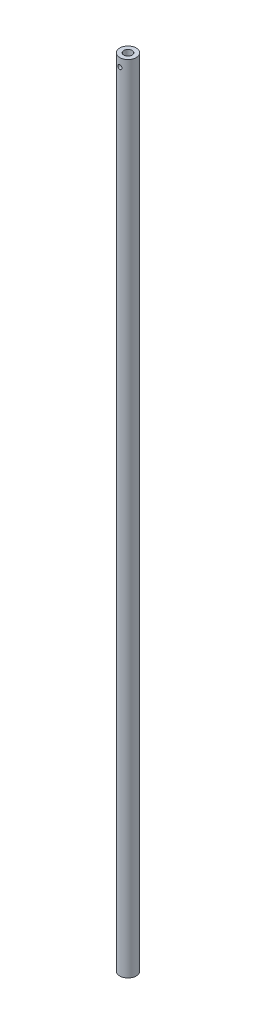
ISO-10303-21;
HEADER;
FILE_DESCRIPTION(('STEP AP214'),'2;1');
FILE_NAME('part.step','',(''),(''),'','','');
FILE_SCHEMA(('AUTOMOTIVE_DESIGN { 1 0 10303 214 1 1 1 1 }'));
ENDSEC;
DATA;
#1=APPLICATION_CONTEXT('core data for automotive mechanical design processes');
#2=APPLICATION_PROTOCOL_DEFINITION('international standard','automotive_design',2000,#1);
#3=PRODUCT_CONTEXT('',#1,'mechanical');
#4=PRODUCT('Part','Part','',(#3));
#5=PRODUCT_RELATED_PRODUCT_CATEGORY('part','',(#4));
#6=PRODUCT_DEFINITION_FORMATION('','',#4);
#7=PRODUCT_DEFINITION_CONTEXT('part definition',#1,'design');
#8=PRODUCT_DEFINITION('design','',#6,#7);
#9=PRODUCT_DEFINITION_SHAPE('','',#8);
#10=(LENGTH_UNIT() NAMED_UNIT(*) SI_UNIT(.MILLI.,.METRE.));
#11=(NAMED_UNIT(*) PLANE_ANGLE_UNIT() SI_UNIT($,.RADIAN.));
#12=(NAMED_UNIT(*) SI_UNIT($,.STERADIAN.) SOLID_ANGLE_UNIT());
#13=UNCERTAINTY_MEASURE_WITH_UNIT(LENGTH_MEASURE(1.E-05),#10,'distance_accuracy_value','');
#14=(GEOMETRIC_REPRESENTATION_CONTEXT(3) GLOBAL_UNCERTAINTY_ASSIGNED_CONTEXT((#13)) GLOBAL_UNIT_ASSIGNED_CONTEXT((#10,
#11,#12)) REPRESENTATION_CONTEXT('',''));
#15=CARTESIAN_POINT('',(0.,0.,0.));
#16=DIRECTION('',(0.,0.,1.));
#17=DIRECTION('',(1.,0.,0.));
#18=AXIS2_PLACEMENT_3D('',#15,#16,#17);
#19=CARTESIAN_POINT('',(0.,1219.2,0.));
#20=DIRECTION('',(0.,1.,0.));
#21=DIRECTION('',(0.,0.,1.));
#22=AXIS2_PLACEMENT_3D('',#19,#20,#21);
#23=PLANE('',#22);
#24=CARTESIAN_POINT('',(0.,1219.2,0.));
#25=DIRECTION('',(0.,1.,0.));
#26=DIRECTION('',(0.,0.,1.));
#27=AXIS2_PLACEMENT_3D('',#24,#25,#26);
#28=CIRCLE('',#27,12.7);
#29=CARTESIAN_POINT('',(0.,1219.2,12.7));
#30=VERTEX_POINT('',#29);
#31=EDGE_CURVE('E10',#30,#30,#28,.T.);
#32=ORIENTED_EDGE('',*,*,#31,.T.);
#33=EDGE_LOOP('',(#32));
#34=FACE_BOUND('',#33,.T.);
#35=CARTESIAN_POINT('',(0.,1219.2,0.));
#36=DIRECTION('',(0.,1.,0.));
#37=DIRECTION('',(0.,0.,1.));
#38=AXIS2_PLACEMENT_3D('',#35,#36,#37);
#39=CIRCLE('',#38,6.34999999999999);
#40=CARTESIAN_POINT('',(0.,1219.2,6.34999999999999));
#41=VERTEX_POINT('',#40);
#42=EDGE_CURVE('E54',#41,#41,#39,.T.);
#43=ORIENTED_EDGE('',*,*,#42,.F.);
#44=EDGE_LOOP('',(#43));
#45=FACE_BOUND('',#44,.T.);
#46=ADVANCED_FACE('F35',(#34,#45),#23,.T.);
#47=CARTESIAN_POINT('',(0.,0.,0.));
#48=DIRECTION('',(0.,1.,0.));
#49=DIRECTION('',(0.,0.,1.));
#50=AXIS2_PLACEMENT_3D('',#47,#48,#49);
#51=PLANE('',#50);
#52=CARTESIAN_POINT('',(0.,0.,0.));
#53=DIRECTION('',(0.,1.,0.));
#54=DIRECTION('',(0.,0.,1.));
#55=AXIS2_PLACEMENT_3D('',#52,#53,#54);
#56=CIRCLE('',#55,12.7);
#57=CARTESIAN_POINT('',(0.,0.,12.7));
#58=VERTEX_POINT('',#57);
#59=EDGE_CURVE('E49',#58,#58,#56,.T.);
#60=ORIENTED_EDGE('',*,*,#59,.F.);
#61=EDGE_LOOP('',(#60));
#62=FACE_BOUND('',#61,.T.);
#63=CARTESIAN_POINT('',(0.,0.,0.));
#64=DIRECTION('',(0.,1.,0.));
#65=DIRECTION('',(0.,0.,1.));
#66=AXIS2_PLACEMENT_3D('',#63,#64,#65);
#67=CIRCLE('',#66,6.34999999999999);
#68=CARTESIAN_POINT('',(0.,0.,6.34999999999999));
#69=VERTEX_POINT('',#68);
#70=EDGE_CURVE('E57',#69,#69,#67,.T.);
#71=ORIENTED_EDGE('',*,*,#70,.T.);
#72=EDGE_LOOP('',(#71));
#73=FACE_BOUND('',#72,.T.);
#74=ADVANCED_FACE('F93',(#62,#73),#51,.F.);
#75=CARTESIAN_POINT('',(0.,1219.2,0.));
#76=DIRECTION('',(0.,-1.,0.));
#77=DIRECTION('',(0.,0.,-1.));
#78=AXIS2_PLACEMENT_3D('',#75,#76,#77);
#79=CYLINDRICAL_SURFACE('',#78,12.7);
#80=CARTESIAN_POINT('',(3.17499999999981,1206.5,12.2967221242086));
#81=CARTESIAN_POINT('',(3.17499501981301,1206.32467554633,12.2967254711159));
#82=CARTESIAN_POINT('',(3.16042833178181,1206.14929597868,12.3005126863854));
#83=CARTESIAN_POINT('',(3.1026393693388,1205.80357317572,12.3152136473056));
#84=CARTESIAN_POINT('',(3.05940041756226,1205.63323293183,12.3261315404947));
#85=CARTESIAN_POINT('',(2.94575382353251,1205.3026395065,12.3537818023711));
#86=CARTESIAN_POINT('',(2.87538125437504,1205.14237361266,12.3705066621688));
#87=CARTESIAN_POINT('',(2.70957184940179,1204.83590521728,12.4078770387653));
#88=CARTESIAN_POINT('',(2.61413394947187,1204.68970331316,12.4285227220068));
#89=CARTESIAN_POINT('',(2.39865970268589,1204.41229571052,12.4719170977165));
#90=CARTESIAN_POINT('',(2.27817284738401,1204.28144512756,12.4946993898125));
#91=CARTESIAN_POINT('',(2.01699122140778,1204.04158302916,12.5395085190442));
#92=CARTESIAN_POINT('',(1.87629456360893,1203.93257355546,12.5615352853931));
#93=CARTESIAN_POINT('',(1.57625440537023,1203.73803515611,12.6027232771114));
#94=CARTESIAN_POINT('',(1.41667811176777,1203.65285508704,12.6218402299875));
#95=CARTESIAN_POINT('',(1.08491424405178,1203.51066175193,12.65467131146));
#96=CARTESIAN_POINT('',(0.912728534955732,1203.45364433007,12.6683862371462));
#97=CARTESIAN_POINT('',(0.564335623617743,1203.37053225009,12.6886304373719));
#98=CARTESIAN_POINT('',(0.388280553827151,1203.34383455171,12.6952996518228));
#99=CARTESIAN_POINT('',(0.0340726004636605,1203.32022685832,12.7011886451627));
#100=CARTESIAN_POINT('',(-0.144079969063406,1203.3233124593,12.7004095254281));
#101=CARTESIAN_POINT('',(-0.493243384772358,1203.35875005982,12.6915938059099));
#102=CARTESIAN_POINT('',(-0.664324984533385,1203.39045113282,12.683718629729));
#103=CARTESIAN_POINT('',(-0.998658935538431,1203.48117351296,12.6617836238657));
#104=CARTESIAN_POINT('',(-1.16191086950113,1203.54019627443,12.6477234649603));
#105=CARTESIAN_POINT('',(-1.47766628361825,1203.68441326477,12.6147513732012));
#106=CARTESIAN_POINT('',(-1.63005931850868,1203.76983914672,12.5957967501266));
#107=CARTESIAN_POINT('',(-1.91857510093102,1203.96426171248,12.5550917783831));
#108=CARTESIAN_POINT('',(-2.05469501139639,1204.07326249707,12.5333409435887));
#109=CARTESIAN_POINT('',(-2.31068256139461,1204.31523010232,12.4887191648708));
#110=CARTESIAN_POINT('',(-2.43001063106365,1204.44876571328,12.4658338379713));
#111=CARTESIAN_POINT('',(-2.64469999368251,1204.7341919664,12.4220610526701));
#112=CARTESIAN_POINT('',(-2.74006016644604,1204.88608346596,12.4011736876753));
#113=CARTESIAN_POINT('',(-2.90445230964658,1205.20496834337,12.3637103097324));
#114=CARTESIAN_POINT('',(-2.97335437513104,1205.3720313775,12.347155693206));
#115=CARTESIAN_POINT('',(-3.08192684552036,1205.71588354446,12.3205067298881));
#116=CARTESIAN_POINT('',(-3.12160350580581,1205.89267058726,12.3104110007027));
#117=CARTESIAN_POINT('',(-3.16970364110553,1206.24594856695,12.2981130212947));
#118=CARTESIAN_POINT('',(-3.17892490187709,1206.42232399755,12.2957093300071));
#119=CARTESIAN_POINT('',(-3.16803657795405,1206.77409385947,12.2985192607316));
#120=CARTESIAN_POINT('',(-3.14792969326905,1206.9494883796,12.3037321815429));
#121=CARTESIAN_POINT('',(-3.07965533920138,1207.29135511649,12.3209949412093));
#122=CARTESIAN_POINT('',(-3.03195236671779,1207.45792636274,12.3329315220802));
#123=CARTESIAN_POINT('',(-2.91035496372127,1207.78070795148,12.3621891219377));
#124=CARTESIAN_POINT('',(-2.83645743059471,1207.936917064,12.3795107787294));
#125=CARTESIAN_POINT('',(-2.66289874827928,1208.23792042289,12.418010941113));
#126=CARTESIAN_POINT('',(-2.56276062737097,1208.38243062686,12.4392584413121));
#127=CARTESIAN_POINT('',(-2.34016643006656,1208.65288922076,12.4830469550032));
#128=CARTESIAN_POINT('',(-2.21770668600701,1208.77883455415,12.5055881806495));
#129=CARTESIAN_POINT('',(-1.95028413912631,1209.01182002407,12.5501070185035));
#130=CARTESIAN_POINT('',(-1.80483494928761,1209.11830827944,12.5720564161859));
#131=CARTESIAN_POINT('',(-1.49765601755539,1209.30534855103,12.6123346509939));
#132=CARTESIAN_POINT('',(-1.33592712544014,1209.38590192009,12.6306636769502));
#133=CARTESIAN_POINT('',(-1.00189729049598,1209.51808646385,12.6615204698767));
#134=CARTESIAN_POINT('',(-0.829682684763281,1209.56992564116,12.6740898412846));
#135=CARTESIAN_POINT('',(-0.478630489012009,1209.64383462495,12.6921932261265));
#136=CARTESIAN_POINT('',(-0.299794184005794,1209.6659101766,12.6977285972964));
#137=CARTESIAN_POINT('',(0.054240196457629,1209.6793420969,12.7010848787296));
#138=CARTESIAN_POINT('',(0.229405900617189,1209.67151292638,12.6991103294396));
#139=CARTESIAN_POINT('',(0.575841801116885,1209.62722314834,12.6881222125238));
#140=CARTESIAN_POINT('',(0.747112113154488,1209.59076339233,12.6791088542401));
#141=CARTESIAN_POINT('',(1.08004303817218,1209.49068420223,12.655087493111));
#142=CARTESIAN_POINT('',(1.24175042029425,1209.42721203573,12.6401120229509));
#143=CARTESIAN_POINT('',(1.55231164340715,1209.27504341161,12.6057434230086));
#144=CARTESIAN_POINT('',(1.70116386101837,1209.18634377427,12.5863497364055));
#145=CARTESIAN_POINT('',(1.98565112274395,1208.98375413206,12.5446551773491));
#146=CARTESIAN_POINT('',(2.12088408784716,1208.86931154628,12.5222957878978));
#147=CARTESIAN_POINT('',(2.37050268936831,1208.61955744497,12.4774531075658));
#148=CARTESIAN_POINT('',(2.48488303211812,1208.48424064635,12.4549697867118));
#149=CARTESIAN_POINT('',(2.69164443404795,1208.19354050995,12.4119473580947));
#150=CARTESIAN_POINT('',(2.78357526664683,1208.03782990832,12.3914523466269));
#151=CARTESIAN_POINT('',(2.93981789665869,1207.71267381965,12.3553205869608));
#152=CARTESIAN_POINT('',(3.00414978846293,1207.54323843265,12.3396803064046));
#153=CARTESIAN_POINT('',(3.09379152821277,1207.22841798743,12.3174731028359));
#154=CARTESIAN_POINT('',(3.1241783166449,1207.08453920308,12.3097500503611));
#155=CARTESIAN_POINT('',(3.16478377891517,1206.79378634093,12.2993733749982));
#156=CARTESIAN_POINT('',(3.17500417313011,1206.64691251973,12.2967193196792));
#157=CARTESIAN_POINT('',(3.17499999999981,1206.5,12.2967221242086));
#158=B_SPLINE_CURVE_WITH_KNOTS('',3,(#80,#81,#82,#83,#84,#85,#86,#87,#88,#89,#90,#91,#92,#93,
#94,#95,#96,#97,#98,#99,#100,#101,#102,#103,#104,#105,#106,#107,#108,#109,#110,#111,#112,#113,
#114,#115,#116,#117,#118,#119,#120,#121,#122,#123,#124,#125,#126,#127,#128,#129,#130,#131,#132,
#133,#134,#135,#136,#137,#138,#139,#140,#141,#142,#143,#144,#145,#146,#147,#148,#149,#150,#151,
#152,#153,#154,#155,#156,#157),.UNSPECIFIED.,.T.,.F.,(4,2,2,2,2,2,2,2,2,2,2,2,2,2,2,2,2,2,2,2,2,
2,2,2,2,2,2,2,2,2,2,2,2,2,2,2,2,2,4),(0.,0.525433851004964,1.05117359161438,1.57623602350071,
2.10132074979462,2.63682421825055,3.17237772279397,3.71540400425325,4.25835013005777,
4.79029713764062,5.32216548805818,5.84223193614927,6.36232607040448,6.88711950303115,
7.41200429545474,7.95109492546283,8.49021074623711,9.0319406865062,9.57355464164484,
10.1008633995049,10.6281236152965,11.1467570436792,11.6654519221142,12.1943221424736,
12.7232793399023,13.2654717033217,13.8076357797005,14.3458193247102,14.8838989712068,
15.4074297658807,15.9309449907496,16.4516419323703,16.9724045329355,17.5056431266542,
18.0390169009438,18.5823412615961,19.1252693614616,19.5655924052576,20.0058778838693),.UNSPECIFIED.);
#159=CARTESIAN_POINT('',(3.17499999999981,1206.5,12.2967221242086));
#160=VERTEX_POINT('',#159);
#161=EDGE_CURVE('E77',#160,#160,#158,.T.);
#162=ORIENTED_EDGE('',*,*,#161,.T.);
#163=EDGE_LOOP('',(#162));
#164=FACE_BOUND('',#163,.T.);
#165=CARTESIAN_POINT('',(0.,1209.675,-12.7));
#166=CARTESIAN_POINT('',(-0.17542105435093,1209.67499507719,-12.6999970338729));
#167=CARTESIAN_POINT('',(-0.350897100741789,1209.6604128842,-12.6963292371236));
#168=CARTESIAN_POINT('',(-0.696820051980949,1209.60255676307,-12.6820530760661));
#169=CARTESIAN_POINT('',(-0.867264049209693,1209.55926657315,-12.6714407780561));
#170=CARTESIAN_POINT('',(-1.19807751278639,1209.44547024684,-12.6444507573613));
#171=CARTESIAN_POINT('',(-1.35845880926011,1209.37499679272,-12.6280799601569));
#172=CARTESIAN_POINT('',(-1.66512267919763,1209.20894939107,-12.591316443928));
#173=CARTESIAN_POINT('',(-1.81140477687146,1209.11337459688,-12.5709235892463));
#174=CARTESIAN_POINT('',(-2.08873074612015,1208.89775832857,-12.5278602543575));
#175=CARTESIAN_POINT('',(-2.21944287729577,1208.77729716634,-12.5051546346353));
#176=CARTESIAN_POINT('',(-2.45903522924685,1208.51622616628,-12.4602582924963));
#177=CARTESIAN_POINT('',(-2.56791298487556,1208.37561405643,-12.4380676284689));
#178=CARTESIAN_POINT('',(-2.76230618225761,1208.07565677008,-12.3963594189446));
#179=CARTESIAN_POINT('',(-2.84745052370805,1207.91606432812,-12.3768864828385));
#180=CARTESIAN_POINT('',(-2.98957345643229,1207.58426586199,-12.343330973648));
#181=CARTESIAN_POINT('',(-3.04655655068149,1207.41206185945,-12.3292475388652));
#182=CARTESIAN_POINT('',(-3.12960773790324,1207.06357626214,-12.3084267567389));
#183=CARTESIAN_POINT('',(-3.15627230130267,1206.88744547005,-12.3015478927701));
#184=CARTESIAN_POINT('',(-3.17978742389037,1206.53308652895,-12.2954915053947));
#185=CARTESIAN_POINT('',(-3.1766428335148,1206.35485872587,-12.2963127290579));
#186=CARTESIAN_POINT('',(-3.14110481048721,1206.00593654027,-12.3054365167727));
#187=CARTESIAN_POINT('',(-3.10942215340335,1205.8351642679,-12.3135572669877));
#188=CARTESIAN_POINT('',(-3.01884119561117,1205.50143910891,-12.3360753547043));
#189=CARTESIAN_POINT('',(-2.95994095604671,1205.33848678026,-12.3504731393489));
#190=CARTESIAN_POINT('',(-2.81599106163348,1205.02312119893,-12.3840899110032));
#191=CARTESIAN_POINT('',(-2.73068344564274,1204.87083093638,-12.4033560981112));
#192=CARTESIAN_POINT('',(-2.53652078423138,1204.58247206435,-12.4445122129068));
#193=CARTESIAN_POINT('',(-2.42766161831183,1204.44640629993,-12.4664025994163));
#194=CARTESIAN_POINT('',(-2.18580424890842,1204.19028568012,-12.5111061380944));
#195=CARTESIAN_POINT('',(-2.05220624645091,1204.07079799604,-12.533927803951));
#196=CARTESIAN_POINT('',(-1.76659522538266,1203.85581503679,-12.5773596047504));
#197=CARTESIAN_POINT('',(-1.61458164448162,1203.76032049448,-12.5979696721291));
#198=CARTESIAN_POINT('',(-1.29564529770878,1203.59582625916,-12.6347586626604));
#199=CARTESIAN_POINT('',(-1.1286731156248,1203.52691869646,-12.6509221227036));
#200=CARTESIAN_POINT('',(-0.785020883902368,1203.41830836958,-12.676884242985));
#201=CARTESIAN_POINT('',(-0.608342698201796,1203.37860001892,-12.6866841206814));
#202=CARTESIAN_POINT('',(-0.255142937325509,1203.33038148624,-12.6986347345774));
#203=CARTESIAN_POINT('',(-0.0787330573083404,1203.32109892814,-12.7009747992585));
#204=CARTESIAN_POINT('',(0.273119584996554,1203.33187705435,-12.6982813685726));
#205=CARTESIAN_POINT('',(0.448562432914423,1203.35193509726,-12.6932485369525));
#206=CARTESIAN_POINT('',(0.79081686891024,1203.42018842276,-12.6764961338622));
#207=CARTESIAN_POINT('',(0.957717835150496,1203.46796234103,-12.6648767569325));
#208=CARTESIAN_POINT('',(1.2811279356911,1203.58980999453,-12.6362609570897));
#209=CARTESIAN_POINT('',(1.43763601861905,1203.6638863858,-12.6192639911647));
#210=CARTESIAN_POINT('',(1.73889063454306,1203.83773313945,-12.5813250177716));
#211=CARTESIAN_POINT('',(1.88337918521895,1203.93793610457,-12.5603183592593));
#212=CARTESIAN_POINT('',(2.15376466554488,1204.16063864029,-12.5167921111412));
#213=CARTESIAN_POINT('',(2.27965837982656,1204.28314205886,-12.4942722608556));
#214=CARTESIAN_POINT('',(2.51246336908657,1204.55055415045,-12.4495762556412));
#215=CARTESIAN_POINT('',(2.61883285313114,1204.69593897135,-12.4274221051899));
#216=CARTESIAN_POINT('',(2.80566443991207,1205.00295074296,-12.3865825924258));
#217=CARTESIAN_POINT('',(2.88612769264163,1205.16457697229,-12.3678970761539));
#218=CARTESIAN_POINT('',(3.01826384028526,1205.49861711243,-12.3363163381503));
#219=CARTESIAN_POINT('',(3.0701073062283,1205.6709601466,-12.3233869021911));
#220=CARTESIAN_POINT('',(3.14398164687956,1206.02228873346,-12.3047494152553));
#221=CARTESIAN_POINT('',(3.16601904149235,1206.20127282466,-12.2990397850061));
#222=CARTESIAN_POINT('',(3.17931501621055,1206.55528950052,-12.2956087422145));
#223=CARTESIAN_POINT('',(3.17143955029519,1206.73028790439,-12.2976625750886));
#224=CARTESIAN_POINT('',(3.1271152390871,1207.07637656438,-12.3090074061494));
#225=CARTESIAN_POINT('',(3.09066696801918,1207.24746689897,-12.3182982588945));
#226=CARTESIAN_POINT('',(2.99070462615674,1207.57994123835,-12.3429450180984));
#227=CARTESIAN_POINT('',(2.92735297324078,1207.74137696276,-12.3582644892528));
#228=CARTESIAN_POINT('',(2.77551073379646,1208.05144339342,-12.3932474960913));
#229=CARTESIAN_POINT('',(2.68701666057199,1208.20007231991,-12.4129116342002));
#230=CARTESIAN_POINT('',(2.48468673461534,1208.48449063139,-12.4550092586011));
#231=CARTESIAN_POINT('',(2.3702500281642,1208.61984393875,-12.4775016056118));
#232=CARTESIAN_POINT('',(2.12045416901807,1208.86970791149,-12.5223699100401));
#233=CARTESIAN_POINT('',(1.98509005500255,1208.98421362041,-12.5447458385544));
#234=CARTESIAN_POINT('',(1.69432305852032,1209.19115393646,-12.5873437112106));
#235=CARTESIAN_POINT('',(1.53860166056956,1209.28315126561,-12.6075193062447));
#236=CARTESIAN_POINT('',(1.2134131592971,1209.43951546323,-12.6429542453062));
#237=CARTESIAN_POINT('',(1.04395600927437,1209.50390213004,-12.6582171100619));
#238=CARTESIAN_POINT('',(0.729001702698632,1209.5936603742,-12.6798505941374));
#239=CARTESIAN_POINT('',(0.585004695088707,1209.6240967978,-12.6873547169486));
#240=CARTESIAN_POINT('',(0.294017851418451,1209.664767914,-12.6974304774095));
#241=CARTESIAN_POINT('',(0.147028241296866,1209.67500412603,-12.7000024860439));
#242=CARTESIAN_POINT('',(0.,1209.675,-12.7));
#243=B_SPLINE_CURVE_WITH_KNOTS('',3,(#165,#166,#167,#168,#169,#170,#171,#172,#173,#174,#175,
#176,#177,#178,#179,#180,#181,#182,#183,#184,#185,#186,#187,#188,#189,#190,#191,#192,#193,#194,
#195,#196,#197,#198,#199,#200,#201,#202,#203,#204,#205,#206,#207,#208,#209,#210,#211,#212,#213,
#214,#215,#216,#217,#218,#219,#220,#221,#222,#223,#224,#225,#226,#227,#228,#229,#230,#231,#232,
#233,#234,#235,#236,#237,#238,#239,#240,#241,#242),.UNSPECIFIED.,.T.,.F.,(4,2,2,2,2,2,2,2,2,2,2,
2,2,2,2,2,2,2,2,2,2,2,2,2,2,2,2,2,2,2,2,2,2,2,2,2,2,2,4),(0.,0.525724358065482,1.05174676993356,
1.57713870983889,2.10254837335831,2.63767221675251,3.17285644277771,3.71599137305263,
4.25903942808484,4.7912082463057,5.32329047345506,5.84247618671843,6.36169889010119,
6.88616284006707,7.41071862276876,7.95023177058084,8.48976139571939,9.0311441807627,
9.57242335981268,10.0998508728294,10.6272309069561,11.1467958106168,11.6664131950581,
12.1952509368695,12.7241800170726,13.2660921115642,13.8079801469342,14.3466027227594,
14.8851074589663,15.4081433519168,15.9311687337367,16.4510804786756,16.971064359065,
17.5046127008436,18.0382877269745,18.5816279265752,19.1245778677191,19.5652441424426,
20.0058772697448),.UNSPECIFIED.);
#244=CARTESIAN_POINT('',(0.,1209.675,-12.7));
#245=VERTEX_POINT('',#244);
#246=EDGE_CURVE('E82',#245,#245,#243,.T.);
#247=ORIENTED_EDGE('',*,*,#246,.T.);
#248=EDGE_LOOP('',(#247));
#249=FACE_BOUND('',#248,.T.);
#250=ORIENTED_EDGE('',*,*,#31,.F.);
#251=EDGE_LOOP('',(#250));
#252=FACE_BOUND('',#251,.T.);
#253=ORIENTED_EDGE('',*,*,#59,.T.);
#254=EDGE_LOOP('',(#253));
#255=FACE_BOUND('',#254,.T.);
#256=ADVANCED_FACE('F37',(#164,#249,#252,#255),#79,.T.);
#257=CARTESIAN_POINT('',(0.,1219.2,0.));
#258=DIRECTION('',(0.,-1.,0.));
#259=DIRECTION('',(0.,0.,-1.));
#260=AXIS2_PLACEMENT_3D('',#257,#258,#259);
#261=CYLINDRICAL_SURFACE('',#260,6.34999999999999);
#262=CARTESIAN_POINT('',(0.,1209.675,-6.34999999999999));
#263=CARTESIAN_POINT('',(-0.0834969220595042,1209.67499911228,-6.34999931166444));
#264=CARTESIAN_POINT('',(-0.167002655580051,1209.67170012556,-6.34834758911701));
#265=CARTESIAN_POINT('',(-0.333378330258795,1209.65855412545,-6.34179105821714));
#266=CARTESIAN_POINT('',(-0.416247978955787,1209.64870426348,-6.33688483467112));
#267=CARTESIAN_POINT('',(-0.663182030647014,1209.60942793496,-6.31742426748324));
#268=CARTESIAN_POINT('',(-0.825450146761522,1209.5702749226,-6.29812827299425));
#269=CARTESIAN_POINT('',(-1.13965128900417,1209.46800928871,-6.24891823135741));
#270=CARTESIAN_POINT('',(-1.29162180811858,1209.40498978076,-6.21904547786826));
#271=CARTESIAN_POINT('',(-1.58264035037867,1209.25726392637,-6.1514281204164));
#272=CARTESIAN_POINT('',(-1.72168939123007,1209.17255928985,-6.1136841371588));
#273=CARTESIAN_POINT('',(-1.99234108848159,1208.97803037027,-6.03111096182986));
#274=CARTESIAN_POINT('',(-2.12298433900077,1208.86699642221,-5.98599127270823));
#275=CARTESIAN_POINT('',(-2.36467069069839,1208.62560331643,-5.89470535591061));
#276=CARTESIAN_POINT('',(-2.47569885601308,1208.49522957024,-5.84853836069048));
#277=CARTESIAN_POINT('',(-2.68368848497872,1208.20657905225,-5.7562363493447));
#278=CARTESIAN_POINT('',(-2.77889135161918,1208.0469224687,-5.71038146176795));
#279=CARTESIAN_POINT('',(-2.90019349951518,1207.79545201283,-5.64919759286371));
#280=CARTESIAN_POINT('',(-2.93705266116876,1207.70959993817,-5.6300642080594));
#281=CARTESIAN_POINT('',(-3.00322508739591,1207.5344143863,-5.59504604853275));
#282=CARTESIAN_POINT('',(-3.03254280972144,1207.44508300182,-5.57915935583436));
#283=CARTESIAN_POINT('',(-3.08174263292964,1207.26898944804,-5.55212611635058));
#284=CARTESIAN_POINT('',(-3.10208128111959,1207.18238920597,-5.54075429137756));
#285=CARTESIAN_POINT('',(-3.13545600360743,1207.00741272101,-5.52193654886456));
#286=CARTESIAN_POINT('',(-3.14849595237236,1206.91903744623,-5.51448854851147));
#287=CARTESIAN_POINT('',(-3.16707713053421,1206.74129326115,-5.50383875782929));
#288=CARTESIAN_POINT('',(-3.17262287599631,1206.65192498201,-5.50063441026532));
#289=CARTESIAN_POINT('',(-3.17614778806973,1206.47301921582,-5.4985978839862));
#290=CARTESIAN_POINT('',(-3.17412767659852,1206.38348174573,-5.49976528812809));
#291=CARTESIAN_POINT('',(-3.15811930330241,1206.13725212428,-5.50899190362743));
#292=CARTESIAN_POINT('',(-3.13621253452945,1205.98115827019,-5.52160857357718));
#293=CARTESIAN_POINT('',(-3.07003746372149,1205.6753533587,-5.55866493052834));
#294=CARTESIAN_POINT('',(-3.02576203854488,1205.52564435098,-5.58310838358085));
#295=CARTESIAN_POINT('',(-2.9153150983363,1205.23245570344,-5.64157885407245));
#296=CARTESIAN_POINT('',(-2.84865758129396,1205.08920239007,-5.67581583876139));
#297=CARTESIAN_POINT('',(-2.69570761526033,1204.81523391383,-5.75003268807642));
#298=CARTESIAN_POINT('',(-2.60940634674613,1204.68452442039,-5.79001512927811));
#299=CARTESIAN_POINT('',(-2.40685964249551,1204.42189572575,-5.87734289018616));
#300=CARTESIAN_POINT('',(-2.28820488335235,1204.29192461515,-5.92497898403942));
#301=CARTESIAN_POINT('',(-2.0305889844841,1204.05291485714,-6.0181370057491));
#302=CARTESIAN_POINT('',(-1.89161819563533,1203.94388621364,-6.06365791538162));
#303=CARTESIAN_POINT('',(-1.58913989972474,1203.74509808028,-6.15003810597681));
#304=CARTESIAN_POINT('',(-1.4247926516478,1203.65646851442,-6.19058274974573));
#305=CARTESIAN_POINT('',(-1.08098023585572,1203.50884191837,-6.25976272299954));
#306=CARTESIAN_POINT('',(-0.901527205073765,1203.44982135887,-6.28840750578947));
#307=CARTESIAN_POINT('',(-0.548533610626697,1203.3679405966,-6.32854759690358));
#308=CARTESIAN_POINT('',(-0.375734359385128,1203.34249032741,-6.34126679122996));
#309=CARTESIAN_POINT('',(-0.0278752299447635,1203.32034947774,-6.35231817716325));
#310=CARTESIAN_POINT('',(0.147183538060058,1203.32364527286,-6.35065718436129));
#311=CARTESIAN_POINT('',(0.480164686080377,1203.35740623595,-6.33384535408398));
#312=CARTESIAN_POINT('',(0.638363620564208,1203.38574579148,-6.3197500506043));
#313=CARTESIAN_POINT('',(0.94744188305301,1203.46545587821,-6.28085393924121));
#314=CARTESIAN_POINT('',(1.09832040207141,1203.51682894848,-6.25605195113515));
#315=CARTESIAN_POINT('',(1.39347133182508,1203.64249513094,-6.19709998236334));
#316=CARTESIAN_POINT('',(1.53743151047816,1203.71740158411,-6.16270299610718));
#317=CARTESIAN_POINT('',(1.81121482341034,1203.88731642569,-6.08787118465666));
#318=CARTESIAN_POINT('',(1.94103189959924,1203.98233337739,-6.04743378954681));
#319=CARTESIAN_POINT('',(2.19636241342672,1204.20053935038,-5.95973602709941));
#320=CARTESIAN_POINT('',(2.32020134681968,1204.32557860711,-5.91219559251102));
#321=CARTESIAN_POINT('',(2.5458938191886,1204.59476235515,-5.81858093231374));
#322=CARTESIAN_POINT('',(2.6477321493524,1204.73891995238,-5.77250773963551));
#323=CARTESIAN_POINT('',(2.83117262876708,1205.05106860196,-5.68487535288745));
#324=CARTESIAN_POINT('',(2.91155594998005,1205.21987576951,-5.64364281441825));
#325=CARTESIAN_POINT('',(3.04191297152926,1205.57134446489,-5.57447679537326));
#326=CARTESIAN_POINT('',(3.09192585492206,1205.75398779785,-5.54652618900876));
#327=CARTESIAN_POINT('',(3.15551086037902,1206.10918995647,-5.51057765714611));
#328=CARTESIAN_POINT('',(3.17212027309694,1206.28103375041,-5.50092192343254));
#329=CARTESIAN_POINT('',(3.17718805563855,1206.6252444425,-5.4980000114537));
#330=CARTESIAN_POINT('',(3.16565862768363,1206.79761108154,-5.50472672904453));
#331=CARTESIAN_POINT('',(3.11761548073637,1207.12066010308,-5.53205211477795));
#332=CARTESIAN_POINT('',(3.08358651207667,1207.27184394173,-5.55126823076279));
#333=CARTESIAN_POINT('',(2.99458164828787,1207.56619083017,-5.59977978302592));
#334=CARTESIAN_POINT('',(2.93959901505977,1207.70935128285,-5.62907846127346));
#335=CARTESIAN_POINT('',(2.80611544421348,1207.99423369943,-5.69685576337185));
#336=CARTESIAN_POINT('',(2.72628260503911,1208.13521280937,-5.73581889480541));
#337=CARTESIAN_POINT('',(2.54682759156568,1208.40269743172,-5.81772207082388));
#338=CARTESIAN_POINT('',(2.44719512169915,1208.52919535994,-5.86066417820136));
#339=CARTESIAN_POINT('',(2.21680287661202,1208.78009752418,-5.95192753761209));
#340=CARTESIAN_POINT('',(2.08373188558696,1208.90237975641,-6.00026839877351));
#341=CARTESIAN_POINT('',(1.79751265125231,1209.12339787324,-6.09212345576753));
#342=CARTESIAN_POINT('',(1.64435365457418,1209.22212106598,-6.13563504323045));
#343=CARTESIAN_POINT('',(1.40178715704475,1209.3502802662,-6.19391073190245));
#344=CARTESIAN_POINT('',(1.31842200030904,1209.38980058368,-6.21223173271386));
#345=CARTESIAN_POINT('',(1.14807701021657,1209.46159947483,-6.24595363475605));
#346=CARTESIAN_POINT('',(1.06109897786295,1209.49388160654,-6.26135597012705));
#347=CARTESIAN_POINT('',(0.884361322813026,1209.55075934592,-6.28875097111982));
#348=CARTESIAN_POINT('',(0.79460824497049,1209.57537171814,-6.30075106809478));
#349=CARTESIAN_POINT('',(0.612925661591499,1209.61666738953,-6.32100983571903));
#350=CARTESIAN_POINT('',(0.520997521680205,1209.6333555322,-6.3292707916836));
#351=CARTESIAN_POINT('',(0.357531347524305,1209.65561628486,-6.34032503263334));
#352=CARTESIAN_POINT('',(0.286274046488541,1209.66287882125,-6.34394670812889));
#353=CARTESIAN_POINT('',(0.14334666894132,1209.67257112654,-6.34878452045566));
#354=CARTESIAN_POINT('',(0.0716765810914125,1209.67500076205,-6.35000059089051));
#355=CARTESIAN_POINT('',(0.,1209.675,-6.34999999999999));
#356=B_SPLINE_CURVE_WITH_KNOTS('',3,(#262,#263,#264,#265,#266,#267,#268,#269,#270,#271,#272,
#273,#274,#275,#276,#277,#278,#279,#280,#281,#282,#283,#284,#285,#286,#287,#288,#289,#290,#291,
#292,#293,#294,#295,#296,#297,#298,#299,#300,#301,#302,#303,#304,#305,#306,#307,#308,#309,#310,
#311,#312,#313,#314,#315,#316,#317,#318,#319,#320,#321,#322,#323,#324,#325,#326,#327,#328,#329,
#330,#331,#332,#333,#334,#335,#336,#337,#338,#339,#340,#341,#342,#343,#344,#345,#346,#347,#348,
#349,#350,#351,#352,#353,#354,#355),.UNSPECIFIED.,.T.,.F.,(4,2,2,2,2,2,2,2,2,2,2,2,2,2,2,2,2,2,
2,2,2,2,2,2,2,2,2,2,2,2,2,2,2,2,2,2,2,2,2,2,2,2,2,2,2,2,4),(0.,0.250415612102695,
0.500940186864007,1.00234854488127,1.50182051324252,2.0012531094009,2.53090025348436,
3.06094897410598,3.63210298373068,3.91787290005964,4.20347350732838,4.47213270490072,
4.74064915090099,5.00900371453872,5.27733267302546,5.74927594687702,6.221369602568,
6.7044597032772,7.18776712793981,7.73235646527835,8.27720530143594,8.84735553323611,
9.41705196489256,9.93956405039286,10.4618285011669,10.9436138594969,11.4254523397097,
11.9210677568133,12.4168946391873,12.9614122158791,13.5063050164593,14.0775857365543,
14.6481278321874,15.1639000911411,15.6794487286227,16.1458838633204,16.6124691169493,
17.1104020806931,17.6085946442294,18.167321035447,18.7263477502415,19.0082017078353,
19.2899168101031,19.5710117490921,19.8519346536832,20.0668939492135,20.281859177688),.UNSPECIFIED.);
#357=CARTESIAN_POINT('',(0.,1209.675,-6.34999999999999));
#358=VERTEX_POINT('',#357);
#359=EDGE_CURVE('E40',#358,#358,#356,.T.);
#360=ORIENTED_EDGE('',*,*,#359,.F.);
#361=EDGE_LOOP('',(#360));
#362=FACE_BOUND('',#361,.T.);
#363=CARTESIAN_POINT('',(3.17499999999981,1206.5,5.49926131403129));
#364=CARTESIAN_POINT('',(3.17499905676803,1206.41723808647,5.49926232876924));
#365=CARTESIAN_POINT('',(3.17175738528229,1206.33446608496,5.50113815093954));
#366=CARTESIAN_POINT('',(3.15884523354666,1206.16957978714,5.50856077670467));
#367=CARTESIAN_POINT('',(3.14917176035617,1206.08746581505,5.51410928932449));
#368=CARTESIAN_POINT('',(3.11062065473069,1205.84283425159,5.53601678924115));
#369=CARTESIAN_POINT('',(3.07221261154079,1205.68217195302,5.55763722742648));
#370=CARTESIAN_POINT('',(2.97211747978055,1205.37140218786,5.61178865498325));
#371=CARTESIAN_POINT('',(2.91055413725146,1205.22124355982,5.64426154586642));
#372=CARTESIAN_POINT('',(2.76627435445909,1204.9333885772,5.71635543890057));
#373=CARTESIAN_POINT('',(2.68355676984037,1204.79569289737,5.75597682772103));
#374=CARTESIAN_POINT('',(2.49131627779811,1204.52417617866,5.84190034267504));
#375=CARTESIAN_POINT('',(2.38014521787019,1204.39161140272,5.88848395338318));
#376=CARTESIAN_POINT('',(2.13758083606017,1204.14602920875,5.98081052060154));
#377=CARTESIAN_POINT('',(2.00617748851775,1204.0330215411,6.0265530476829));
#378=CARTESIAN_POINT('',(1.71605436473835,1203.82230904715,6.1157318734658));
#379=CARTESIAN_POINT('',(1.5560903252757,1203.72614922106,6.15880487346134));
#380=CARTESIAN_POINT('',(1.21969855929212,1203.56267785689,6.23413651147245));
#381=CARTESIAN_POINT('',(1.0432813088409,1203.49534811282,6.26640197156113));
#382=CARTESIAN_POINT('',(0.692292696730159,1203.39642268546,6.31445464313239));
#383=CARTESIAN_POINT('',(0.51848318375795,1203.36262525321,6.33125099630316));
#384=CARTESIAN_POINT('',(0.166911747158661,1203.32447257382,6.35024078782237));
#385=CARTESIAN_POINT('',(-0.0108477196168561,1203.32009951225,6.3524430618783));
#386=CARTESIAN_POINT('',(-0.348718268640322,1203.34007070121,6.34247467450732));
#387=CARTESIAN_POINT('',(-0.509019820270748,1203.36195074322,6.33153724004096));
#388=CARTESIAN_POINT('',(-0.823321212955378,1203.42939663546,6.29838229153243));
#389=CARTESIAN_POINT('',(-0.97732058152535,1203.47496425809,6.27616393341036));
#390=CARTESIAN_POINT('',(-1.27733236684476,1203.58878731402,6.22209775234816));
#391=CARTESIAN_POINT('',(-1.42320480220683,1203.65734792052,6.19012095460313));
#392=CARTESIAN_POINT('',(-1.70172616219331,1203.81478572002,6.11942032404915));
#393=CARTESIAN_POINT('',(-1.83437032813191,1203.90367018665,6.08069407688629));
#394=CARTESIAN_POINT('',(-2.0960521197436,1204.10889530159,5.99580926070809));
#395=CARTESIAN_POINT('',(-2.2235635961279,1204.22703709043,5.94929416927825));
#396=CARTESIAN_POINT('',(-2.4577784655588,1204.48256239352,5.8564263330752));
#397=CARTESIAN_POINT('',(-2.56446584928017,1204.61996057354,5.81007373990267));
#398=CARTESIAN_POINT('',(-2.76069102698811,1204.92094776837,5.71957289604349));
#399=CARTESIAN_POINT('',(-2.8487095135254,1205.08564591106,5.67575155752792));
#400=CARTESIAN_POINT('',(-2.9584950304644,1205.34383756613,5.6188524741584));
#401=CARTESIAN_POINT('',(-2.99138760520285,1205.43177792851,5.60135560040996));
#402=CARTESIAN_POINT('',(-3.04938956554732,1205.61079743821,5.56999217748627));
#403=CARTESIAN_POINT('',(-3.07450375064131,1205.70187461132,5.55612339050232));
#404=CARTESIAN_POINT('',(-3.11492823782848,1205.87915163141,5.53355357587721));
#405=CARTESIAN_POINT('',(-3.13085491331019,1205.96517064214,5.52453156228574));
#406=CARTESIAN_POINT('',(-3.15556797554211,1206.13851062759,5.51045313491473));
#407=CARTESIAN_POINT('',(-3.16435807553671,1206.22583090114,5.50539465890774));
#408=CARTESIAN_POINT('',(-3.17466835866988,1206.40101514887,5.49945626530661));
#409=CARTESIAN_POINT('',(-3.17619124884829,1206.48887890839,5.49857479177751));
#410=CARTESIAN_POINT('',(-3.17195985852063,1206.66434483764,5.50101508803309));
#411=CARTESIAN_POINT('',(-3.1662060692196,1206.75194702463,5.50433657410117));
#412=CARTESIAN_POINT('',(-3.14018226453013,1206.99409258565,5.51925588435856));
#413=CARTESIAN_POINT('',(-3.11209439281004,1207.14760560753,5.53528611699037));
#414=CARTESIAN_POINT('',(-3.03433762958341,1207.4473468806,5.57828096923602));
#415=CARTESIAN_POINT('',(-2.98466174914462,1207.59357275552,5.6052491297212));
#416=CARTESIAN_POINT('',(-2.86273054239662,1207.88242262665,5.6685262578897));
#417=CARTESIAN_POINT('',(-2.78953600385239,1208.02456613203,5.7052099977015));
#418=CARTESIAN_POINT('',(-2.6234615766981,1208.29536718477,5.7834564691365));
#419=CARTESIAN_POINT('',(-2.53057157570851,1208.42401775344,5.82502170218962));
#420=CARTESIAN_POINT('',(-2.31405795861355,1208.68115687152,5.91464405440164));
#421=CARTESIAN_POINT('',(-2.18803622695163,1208.8075807617,5.96285904289693));
#422=CARTESIAN_POINT('',(-1.91580928554158,1209.03813404752,6.05581193279069));
#423=CARTESIAN_POINT('',(-1.76959728537391,1209.14225591233,6.10054865642876));
#424=CARTESIAN_POINT('',(-1.45584977269228,1209.32757152668,6.18303824145365));
#425=CARTESIAN_POINT('',(-1.28785333421892,1209.40808763683,6.22057562531788));
#426=CARTESIAN_POINT('',(-0.938283508313359,1209.53891285823,6.28279651772889));
#427=CARTESIAN_POINT('',(-0.75672220080601,1209.58924849388,6.30749131056508));
#428=CARTESIAN_POINT('',(-0.403160492410568,1209.65394519054,6.33944338582816));
#429=CARTESIAN_POINT('',(-0.231811338563119,1209.6711832643,6.34809271326659));
#430=CARTESIAN_POINT('',(0.111525009731868,1209.67767735943,6.35133763722965));
#431=CARTESIAN_POINT('',(0.283511959769472,1209.66694317629,6.34593815345489));
#432=CARTESIAN_POINT('',(0.611308110350889,1209.61970294044,6.32250351776754));
#433=CARTESIAN_POINT('',(0.767436553820651,1209.58494172014,6.30532443151583));
#434=CARTESIAN_POINT('',(1.07139095342129,1209.49298666067,6.26084894800278));
#435=CARTESIAN_POINT('',(1.21921571544182,1209.43578960451,6.23355109988089));
#436=CARTESIAN_POINT('',(1.50946910032135,1209.29804206214,6.16984840144775));
#437=CARTESIAN_POINT('',(1.6513965117632,1209.21659737188,6.13310397734645));
#438=CARTESIAN_POINT('',(1.92016030444462,1209.03378184567,6.05434784579293));
#439=CARTESIAN_POINT('',(2.04698971133066,1208.93240185775,6.01233372232389));
#440=CARTESIAN_POINT('',(2.29524860659573,1208.70092616871,5.92228494250571));
#441=CARTESIAN_POINT('',(2.41488454123009,1208.56897676885,5.87406724075611));
#442=CARTESIAN_POINT('',(2.63101905620376,1208.28606626946,5.78049654064406));
#443=CARTESIAN_POINT('',(2.72749716677429,1208.13508852874,5.73514610261339));
#444=CARTESIAN_POINT('',(2.85396050304122,1207.89432051876,5.67271720109902));
#445=CARTESIAN_POINT('',(2.89354057606807,1207.8102422773,5.652571235988));
#446=CARTESIAN_POINT('',(2.96535747654701,1207.63839277548,5.61522862075777));
#447=CARTESIAN_POINT('',(2.9975980864379,1207.55062344512,5.59803045260699));
#448=CARTESIAN_POINT('',(3.05427194354523,1207.37223099158,5.56731186793833));
#449=CARTESIAN_POINT('',(3.07872527562266,1207.28161588317,5.5537820038046));
#450=CARTESIAN_POINT('',(3.11956903021295,1207.09811152146,5.53094387019918));
#451=CARTESIAN_POINT('',(3.13596509002501,1207.00522390603,5.52163264949553));
#452=CARTESIAN_POINT('',(3.15710761797204,1206.84353625121,5.50956192150417));
#453=CARTESIAN_POINT('',(3.16381073091685,1206.77506632724,5.50570868405789));
#454=CARTESIAN_POINT('',(3.17275746354998,1206.63773328139,5.50055787263136));
#455=CARTESIAN_POINT('',(3.17500078490793,1206.5688701335,5.49926046961948));
#456=CARTESIAN_POINT('',(3.17499999999981,1206.5,5.49926131403129));
#457=B_SPLINE_CURVE_WITH_KNOTS('',3,(#363,#364,#365,#366,#367,#368,#369,#370,#371,#372,#373,
#374,#375,#376,#377,#378,#379,#380,#381,#382,#383,#384,#385,#386,#387,#388,#389,#390,#391,#392,
#393,#394,#395,#396,#397,#398,#399,#400,#401,#402,#403,#404,#405,#406,#407,#408,#409,#410,#411,
#412,#413,#414,#415,#416,#417,#418,#419,#420,#421,#422,#423,#424,#425,#426,#427,#428,#429,#430,
#431,#432,#433,#434,#435,#436,#437,#438,#439,#440,#441,#442,#443,#444,#445,#446,#447,#448,#449,
#450,#451,#452,#453,#454,#455,#456),.UNSPECIFIED.,.T.,.F.,(4,2,2,2,2,2,2,2,2,2,2,2,2,2,2,2,2,2,
2,2,2,2,2,2,2,2,2,2,2,2,2,2,2,2,2,2,2,2,2,2,2,2,2,2,2,2,4),(0.,0.248210314193582,
0.496536210173063,0.993616655653438,1.48807751301499,1.98256512428755,2.51783706318105,
3.05337510292793,3.62501229957991,4.1962879771027,4.72691486873098,5.25722047303076,
5.741410316133,6.22563639342809,6.71656194871286,7.20766347536995,7.74518754975498,
8.28312325280679,8.85521994590894,9.14138502893488,9.4273731865577,9.69083660833516,
9.95416285897604,10.2173910127763,10.4806013985698,10.9489167635517,11.417383854684,
11.9075481007322,12.3979646273257,12.9502005485235,13.5026226528968,14.0696241997006,
14.6361266987674,15.1506510247051,15.6649951955474,16.1454469295087,16.6259675788452,
17.1270402751819,17.6283435455365,18.1795366185785,18.7312151251723,19.0161455986989,
19.30092889739,19.5849716229012,19.868815332957,20.0753491522859,20.2818967868875),.UNSPECIFIED.);
#458=CARTESIAN_POINT('',(3.17499999999981,1206.5,5.49926131403129));
#459=VERTEX_POINT('',#458);
#460=EDGE_CURVE('E59',#459,#459,#457,.T.);
#461=ORIENTED_EDGE('',*,*,#460,.F.);
#462=EDGE_LOOP('',(#461));
#463=FACE_BOUND('',#462,.T.);
#464=ORIENTED_EDGE('',*,*,#42,.T.);
#465=EDGE_LOOP('',(#464));
#466=FACE_BOUND('',#465,.T.);
#467=ORIENTED_EDGE('',*,*,#70,.F.);
#468=EDGE_LOOP('',(#467));
#469=FACE_BOUND('',#468,.T.);
#470=ADVANCED_FACE('F64',(#362,#463,#466,#469),#261,.F.);
#471=CARTESIAN_POINT('',(0.,1206.5,-12.7));
#472=DIRECTION('',(0.,0.,1.));
#473=DIRECTION('',(1.,0.,0.));
#474=AXIS2_PLACEMENT_3D('',#471,#472,#473);
#475=CYLINDRICAL_SURFACE('',#474,3.17499999999981);
#476=ORIENTED_EDGE('',*,*,#460,.T.);
#477=EDGE_LOOP('',(#476));
#478=FACE_BOUND('',#477,.T.);
#479=ORIENTED_EDGE('',*,*,#161,.F.);
#480=EDGE_LOOP('',(#479));
#481=FACE_BOUND('',#480,.T.);
#482=ADVANCED_FACE('F70',(#478,#481),#475,.F.);
#483=ORIENTED_EDGE('',*,*,#359,.T.);
#484=EDGE_LOOP('',(#483));
#485=FACE_BOUND('',#484,.T.);
#486=ORIENTED_EDGE('',*,*,#246,.F.);
#487=EDGE_LOOP('',(#486));
#488=FACE_BOUND('',#487,.T.);
#489=ADVANCED_FACE('F67',(#485,#488),#475,.F.);
#490=CLOSED_SHELL('',(#46,#74,#256,#470,#482,#489));
#491=MANIFOLD_SOLID_BREP('B2',#490);
#492=ADVANCED_BREP_SHAPE_REPRESENTATION('',(#18,#491),#14);
#493=SHAPE_DEFINITION_REPRESENTATION(#9,#492);
ENDSEC;
END-ISO-10303-21;
